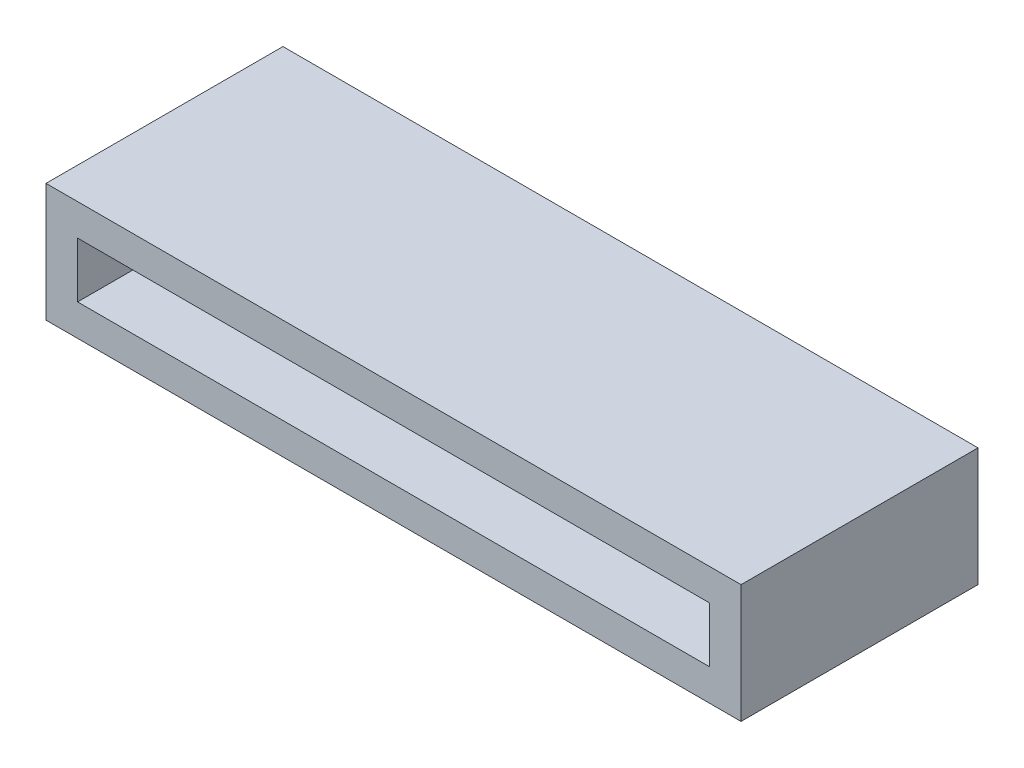
ISO-10303-21;
HEADER;
FILE_DESCRIPTION(('STEP AP214'),'2;1');
FILE_NAME('part.step','',(''),(''),'','','');
FILE_SCHEMA(('AUTOMOTIVE_DESIGN { 1 0 10303 214 1 1 1 1 }'));
ENDSEC;
DATA;
#1=APPLICATION_CONTEXT('core data for automotive mechanical design processes');
#2=APPLICATION_PROTOCOL_DEFINITION('international standard','automotive_design',2000,#1);
#3=PRODUCT_CONTEXT('',#1,'mechanical');
#4=PRODUCT('Part','Part','',(#3));
#5=PRODUCT_RELATED_PRODUCT_CATEGORY('part','',(#4));
#6=PRODUCT_DEFINITION_FORMATION('','',#4);
#7=PRODUCT_DEFINITION_CONTEXT('part definition',#1,'design');
#8=PRODUCT_DEFINITION('design','',#6,#7);
#9=PRODUCT_DEFINITION_SHAPE('','',#8);
#10=(LENGTH_UNIT() NAMED_UNIT(*) SI_UNIT(.MILLI.,.METRE.));
#11=(NAMED_UNIT(*) PLANE_ANGLE_UNIT() SI_UNIT($,.RADIAN.));
#12=(NAMED_UNIT(*) SI_UNIT($,.STERADIAN.) SOLID_ANGLE_UNIT());
#13=UNCERTAINTY_MEASURE_WITH_UNIT(LENGTH_MEASURE(1.E-05),#10,'distance_accuracy_value','');
#14=(GEOMETRIC_REPRESENTATION_CONTEXT(3) GLOBAL_UNCERTAINTY_ASSIGNED_CONTEXT((#13)) GLOBAL_UNIT_ASSIGNED_CONTEXT((#10,
#11,#12)) REPRESENTATION_CONTEXT('',''));
#15=CARTESIAN_POINT('',(0.,0.,0.));
#16=DIRECTION('',(0.,0.,1.));
#17=DIRECTION('',(1.,0.,0.));
#18=AXIS2_PLACEMENT_3D('',#15,#16,#17);
#19=CARTESIAN_POINT('',(0.,0.,7.5));
#20=DIRECTION('',(0.,0.,-1.));
#21=DIRECTION('',(-1.,0.,0.));
#22=AXIS2_PLACEMENT_3D('',#19,#20,#21);
#23=PLANE('',#22);
#24=DIRECTION('',(0.,-1.,0.));
#25=VECTOR('',#24,1.);
#26=CARTESIAN_POINT('',(-11.,1.875,7.5));
#27=LINE('',#26,#25);
#28=CARTESIAN_POINT('',(-11.,1.875,7.5));
#29=VERTEX_POINT('',#28);
#30=CARTESIAN_POINT('',(-11.,-1.875,7.5));
#31=VERTEX_POINT('',#30);
#32=EDGE_CURVE('E150',#29,#31,#27,.T.);
#33=ORIENTED_EDGE('',*,*,#32,.T.);
#34=DIRECTION('',(1.,0.,0.));
#35=VECTOR('',#34,1.);
#36=CARTESIAN_POINT('',(11.,-1.875,7.5));
#37=LINE('',#36,#35);
#38=CARTESIAN_POINT('',(11.,-1.875,7.5));
#39=VERTEX_POINT('',#38);
#40=EDGE_CURVE('E91',#31,#39,#37,.T.);
#41=ORIENTED_EDGE('',*,*,#40,.T.);
#42=DIRECTION('',(0.,1.,0.));
#43=VECTOR('',#42,1.);
#44=CARTESIAN_POINT('',(11.,1.875,7.5));
#45=LINE('',#44,#43);
#46=CARTESIAN_POINT('',(11.,1.875,7.5));
#47=VERTEX_POINT('',#46);
#48=EDGE_CURVE('E148',#39,#47,#45,.T.);
#49=ORIENTED_EDGE('',*,*,#48,.T.);
#50=DIRECTION('',(-1.,0.,0.));
#51=VECTOR('',#50,1.);
#52=CARTESIAN_POINT('',(11.,1.875,7.5));
#53=LINE('',#52,#51);
#54=EDGE_CURVE('E61',#47,#29,#53,.T.);
#55=ORIENTED_EDGE('',*,*,#54,.T.);
#56=EDGE_LOOP('',(#33,#41,#49,#55));
#57=FACE_BOUND('',#56,.T.);
#58=DIRECTION('',(0.,-1.,0.));
#59=VECTOR('',#58,1.);
#60=CARTESIAN_POINT('',(-10.,0.,7.5));
#61=LINE('',#60,#59);
#62=CARTESIAN_POINT('',(-10.,0.874999999999999,7.5));
#63=VERTEX_POINT('',#62);
#64=CARTESIAN_POINT('',(-10.,-0.875000000000001,7.5));
#65=VERTEX_POINT('',#64);
#66=EDGE_CURVE('E136',#63,#65,#61,.T.);
#67=ORIENTED_EDGE('',*,*,#66,.F.);
#68=DIRECTION('',(-1.,0.,0.));
#69=VECTOR('',#68,1.);
#70=CARTESIAN_POINT('',(0.,0.875,7.5));
#71=LINE('',#70,#69);
#72=CARTESIAN_POINT('',(10.,0.875000000000002,7.5));
#73=VERTEX_POINT('',#72);
#74=EDGE_CURVE('E144',#73,#63,#71,.T.);
#75=ORIENTED_EDGE('',*,*,#74,.F.);
#76=DIRECTION('',(0.,1.,0.));
#77=VECTOR('',#76,1.);
#78=CARTESIAN_POINT('',(10.,0.,7.5));
#79=LINE('',#78,#77);
#80=CARTESIAN_POINT('',(10.,-0.874999999999998,7.5));
#81=VERTEX_POINT('',#80);
#82=EDGE_CURVE('E142',#81,#73,#79,.T.);
#83=ORIENTED_EDGE('',*,*,#82,.F.);
#84=DIRECTION('',(1.,0.,0.));
#85=VECTOR('',#84,1.);
#86=CARTESIAN_POINT('',(0.,-0.874999999999999,7.5));
#87=LINE('',#86,#85);
#88=EDGE_CURVE('E126',#65,#81,#87,.T.);
#89=ORIENTED_EDGE('',*,*,#88,.F.);
#90=EDGE_LOOP('',(#67,#75,#83,#89));
#91=FACE_BOUND('',#90,.T.);
#92=ADVANCED_FACE('F39',(#57,#91),#23,.F.);
#93=CARTESIAN_POINT('',(-11.,1.875,7.5));
#94=DIRECTION('',(1.,0.,0.));
#95=DIRECTION('',(0.,1.,0.));
#96=AXIS2_PLACEMENT_3D('',#93,#94,#95);
#97=PLANE('',#96);
#98=DIRECTION('',(0.,-1.,0.));
#99=VECTOR('',#98,1.);
#100=CARTESIAN_POINT('',(-11.,1.875,0.));
#101=LINE('',#100,#99);
#102=CARTESIAN_POINT('',(-11.,1.875,0.));
#103=VERTEX_POINT('',#102);
#104=CARTESIAN_POINT('',(-11.,-1.875,0.));
#105=VERTEX_POINT('',#104);
#106=EDGE_CURVE('E152',#103,#105,#101,.T.);
#107=ORIENTED_EDGE('',*,*,#106,.T.);
#108=DIRECTION('',(0.,0.,-1.));
#109=VECTOR('',#108,1.);
#110=CARTESIAN_POINT('',(-11.,-1.875,7.5));
#111=LINE('',#110,#109);
#112=EDGE_CURVE('E11',#31,#105,#111,.T.);
#113=ORIENTED_EDGE('',*,*,#112,.F.);
#114=ORIENTED_EDGE('',*,*,#32,.F.);
#115=DIRECTION('',(0.,0.,-1.));
#116=VECTOR('',#115,1.);
#117=CARTESIAN_POINT('',(-11.,1.875,7.5));
#118=LINE('',#117,#116);
#119=EDGE_CURVE('E151',#29,#103,#118,.T.);
#120=ORIENTED_EDGE('',*,*,#119,.T.);
#121=EDGE_LOOP('',(#107,#113,#114,#120));
#122=FACE_BOUND('',#121,.T.);
#123=ADVANCED_FACE('F41',(#122),#97,.F.);
#124=CARTESIAN_POINT('',(11.,-1.875,7.5));
#125=DIRECTION('',(0.,1.,0.));
#126=DIRECTION('',(-1.,0.,0.));
#127=AXIS2_PLACEMENT_3D('',#124,#125,#126);
#128=PLANE('',#127);
#129=DIRECTION('',(1.,0.,0.));
#130=VECTOR('',#129,1.);
#131=CARTESIAN_POINT('',(11.,-1.875,0.));
#132=LINE('',#131,#130);
#133=CARTESIAN_POINT('',(11.,-1.875,0.));
#134=VERTEX_POINT('',#133);
#135=EDGE_CURVE('E160',#105,#134,#132,.T.);
#136=ORIENTED_EDGE('',*,*,#135,.T.);
#137=DIRECTION('',(0.,0.,-1.));
#138=VECTOR('',#137,1.);
#139=CARTESIAN_POINT('',(11.,-1.875,7.5));
#140=LINE('',#139,#138);
#141=EDGE_CURVE('E50',#39,#134,#140,.T.);
#142=ORIENTED_EDGE('',*,*,#141,.F.);
#143=ORIENTED_EDGE('',*,*,#40,.F.);
#144=ORIENTED_EDGE('',*,*,#112,.T.);
#145=EDGE_LOOP('',(#136,#142,#143,#144));
#146=FACE_BOUND('',#145,.T.);
#147=ADVANCED_FACE('F184',(#146),#128,.F.);
#148=CARTESIAN_POINT('',(11.,1.875,7.5));
#149=DIRECTION('',(-1.,0.,0.));
#150=DIRECTION('',(0.,0.,1.));
#151=AXIS2_PLACEMENT_3D('',#148,#149,#150);
#152=PLANE('',#151);
#153=DIRECTION('',(0.,1.,0.));
#154=VECTOR('',#153,1.);
#155=CARTESIAN_POINT('',(11.,1.875,0.));
#156=LINE('',#155,#154);
#157=CARTESIAN_POINT('',(11.,1.875,0.));
#158=VERTEX_POINT('',#157);
#159=EDGE_CURVE('E159',#134,#158,#156,.T.);
#160=ORIENTED_EDGE('',*,*,#159,.T.);
#161=DIRECTION('',(0.,0.,-1.));
#162=VECTOR('',#161,1.);
#163=CARTESIAN_POINT('',(11.,1.875,7.5));
#164=LINE('',#163,#162);
#165=EDGE_CURVE('E161',#47,#158,#164,.T.);
#166=ORIENTED_EDGE('',*,*,#165,.F.);
#167=ORIENTED_EDGE('',*,*,#48,.F.);
#168=ORIENTED_EDGE('',*,*,#141,.T.);
#169=EDGE_LOOP('',(#160,#166,#167,#168));
#170=FACE_BOUND('',#169,.T.);
#171=ADVANCED_FACE('F166',(#170),#152,.F.);
#172=CARTESIAN_POINT('',(11.,1.875,7.5));
#173=DIRECTION('',(0.,-1.,0.));
#174=DIRECTION('',(1.,0.,0.));
#175=AXIS2_PLACEMENT_3D('',#172,#173,#174);
#176=PLANE('',#175);
#177=DIRECTION('',(-1.,0.,0.));
#178=VECTOR('',#177,1.);
#179=CARTESIAN_POINT('',(11.,1.875,0.));
#180=LINE('',#179,#178);
#181=EDGE_CURVE('E84',#158,#103,#180,.T.);
#182=ORIENTED_EDGE('',*,*,#181,.T.);
#183=ORIENTED_EDGE('',*,*,#119,.F.);
#184=ORIENTED_EDGE('',*,*,#54,.F.);
#185=ORIENTED_EDGE('',*,*,#165,.T.);
#186=EDGE_LOOP('',(#182,#183,#184,#185));
#187=FACE_BOUND('',#186,.T.);
#188=ADVANCED_FACE('F176',(#187),#176,.F.);
#189=CARTESIAN_POINT('',(0.,0.,0.));
#190=DIRECTION('',(0.,0.,-1.));
#191=DIRECTION('',(-1.,0.,0.));
#192=AXIS2_PLACEMENT_3D('',#189,#190,#191);
#193=PLANE('',#192);
#194=ORIENTED_EDGE('',*,*,#106,.F.);
#195=ORIENTED_EDGE('',*,*,#181,.F.);
#196=ORIENTED_EDGE('',*,*,#159,.F.);
#197=ORIENTED_EDGE('',*,*,#135,.F.);
#198=EDGE_LOOP('',(#194,#195,#196,#197));
#199=FACE_BOUND('',#198,.T.);
#200=ADVANCED_FACE('F175',(#199),#193,.T.);
#201=CARTESIAN_POINT('',(-10.,1.875,7.5));
#202=DIRECTION('',(1.,0.,0.));
#203=DIRECTION('',(0.,1.,0.));
#204=AXIS2_PLACEMENT_3D('',#201,#202,#203);
#205=PLANE('',#204);
#206=DIRECTION('',(0.,-1.,0.));
#207=VECTOR('',#206,1.);
#208=CARTESIAN_POINT('',(-10.,0.,1.));
#209=LINE('',#208,#207);
#210=CARTESIAN_POINT('',(-10.,0.874999999999999,1.));
#211=VERTEX_POINT('',#210);
#212=CARTESIAN_POINT('',(-10.,-0.875000000000001,1.));
#213=VERTEX_POINT('',#212);
#214=EDGE_CURVE('E117',#211,#213,#209,.T.);
#215=ORIENTED_EDGE('',*,*,#214,.F.);
#216=DIRECTION('',(0.,0.,-1.));
#217=VECTOR('',#216,1.);
#218=CARTESIAN_POINT('',(-10.,0.874999999999999,7.5));
#219=LINE('',#218,#217);
#220=EDGE_CURVE('E137',#63,#211,#219,.T.);
#221=ORIENTED_EDGE('',*,*,#220,.F.);
#222=ORIENTED_EDGE('',*,*,#66,.T.);
#223=DIRECTION('',(0.,0.,-1.));
#224=VECTOR('',#223,1.);
#225=CARTESIAN_POINT('',(-10.,-0.875000000000001,7.5));
#226=LINE('',#225,#224);
#227=EDGE_CURVE('E131',#65,#213,#226,.T.);
#228=ORIENTED_EDGE('',*,*,#227,.T.);
#229=EDGE_LOOP('',(#215,#221,#222,#228));
#230=FACE_BOUND('',#229,.T.);
#231=ADVANCED_FACE('F183',(#230),#205,.T.);
#232=CARTESIAN_POINT('',(11.,-0.874999999999997,7.5));
#233=DIRECTION('',(0.,1.,0.));
#234=DIRECTION('',(-1.,0.,0.));
#235=AXIS2_PLACEMENT_3D('',#232,#233,#234);
#236=PLANE('',#235);
#237=DIRECTION('',(1.,0.,0.));
#238=VECTOR('',#237,1.);
#239=CARTESIAN_POINT('',(0.,-0.874999999999999,1.));
#240=LINE('',#239,#238);
#241=CARTESIAN_POINT('',(10.,-0.874999999999998,1.));
#242=VERTEX_POINT('',#241);
#243=EDGE_CURVE('E111',#213,#242,#240,.T.);
#244=ORIENTED_EDGE('',*,*,#243,.F.);
#245=ORIENTED_EDGE('',*,*,#227,.F.);
#246=ORIENTED_EDGE('',*,*,#88,.T.);
#247=DIRECTION('',(0.,0.,-1.));
#248=VECTOR('',#247,1.);
#249=CARTESIAN_POINT('',(10.,-0.874999999999997,7.5));
#250=LINE('',#249,#248);
#251=EDGE_CURVE('E124',#81,#242,#250,.T.);
#252=ORIENTED_EDGE('',*,*,#251,.T.);
#253=EDGE_LOOP('',(#244,#245,#246,#252));
#254=FACE_BOUND('',#253,.T.);
#255=ADVANCED_FACE('F128',(#254),#236,.T.);
#256=CARTESIAN_POINT('',(10.,1.875,7.5));
#257=DIRECTION('',(-1.,0.,0.));
#258=DIRECTION('',(0.,0.,1.));
#259=AXIS2_PLACEMENT_3D('',#256,#257,#258);
#260=PLANE('',#259);
#261=DIRECTION('',(0.,1.,0.));
#262=VECTOR('',#261,1.);
#263=CARTESIAN_POINT('',(10.,0.,1.));
#264=LINE('',#263,#262);
#265=CARTESIAN_POINT('',(10.,0.875000000000002,1.));
#266=VERTEX_POINT('',#265);
#267=EDGE_CURVE('E120',#242,#266,#264,.T.);
#268=ORIENTED_EDGE('',*,*,#267,.F.);
#269=ORIENTED_EDGE('',*,*,#251,.F.);
#270=ORIENTED_EDGE('',*,*,#82,.T.);
#271=DIRECTION('',(0.,0.,-1.));
#272=VECTOR('',#271,1.);
#273=CARTESIAN_POINT('',(10.,0.875000000000002,7.5));
#274=LINE('',#273,#272);
#275=EDGE_CURVE('E53',#73,#266,#274,.T.);
#276=ORIENTED_EDGE('',*,*,#275,.T.);
#277=EDGE_LOOP('',(#268,#269,#270,#276));
#278=FACE_BOUND('',#277,.T.);
#279=ADVANCED_FACE('F133',(#278),#260,.T.);
#280=CARTESIAN_POINT('',(11.,0.875000000000002,7.5));
#281=DIRECTION('',(0.,-1.,0.));
#282=DIRECTION('',(1.,0.,0.));
#283=AXIS2_PLACEMENT_3D('',#280,#281,#282);
#284=PLANE('',#283);
#285=DIRECTION('',(-1.,0.,0.));
#286=VECTOR('',#285,1.);
#287=CARTESIAN_POINT('',(0.,0.875,1.));
#288=LINE('',#287,#286);
#289=EDGE_CURVE('E132',#266,#211,#288,.T.);
#290=ORIENTED_EDGE('',*,*,#289,.F.);
#291=ORIENTED_EDGE('',*,*,#275,.F.);
#292=ORIENTED_EDGE('',*,*,#74,.T.);
#293=ORIENTED_EDGE('',*,*,#220,.T.);
#294=EDGE_LOOP('',(#290,#291,#292,#293));
#295=FACE_BOUND('',#294,.T.);
#296=ADVANCED_FACE('F200',(#295),#284,.T.);
#297=CARTESIAN_POINT('',(0.,0.,1.));
#298=DIRECTION('',(0.,0.,-1.));
#299=DIRECTION('',(-1.,0.,0.));
#300=AXIS2_PLACEMENT_3D('',#297,#298,#299);
#301=PLANE('',#300);
#302=ORIENTED_EDGE('',*,*,#214,.T.);
#303=ORIENTED_EDGE('',*,*,#243,.T.);
#304=ORIENTED_EDGE('',*,*,#267,.T.);
#305=ORIENTED_EDGE('',*,*,#289,.T.);
#306=EDGE_LOOP('',(#302,#303,#304,#305));
#307=FACE_BOUND('',#306,.T.);
#308=ADVANCED_FACE('F113',(#307),#301,.F.);
#309=CLOSED_SHELL('',(#92,#123,#147,#171,#188,#200,#231,#255,#279,#296,#308));
#310=MANIFOLD_SOLID_BREP('B2',#309);
#311=ADVANCED_BREP_SHAPE_REPRESENTATION('',(#18,#310),#14);
#312=SHAPE_DEFINITION_REPRESENTATION(#9,#311);
ENDSEC;
END-ISO-10303-21;
